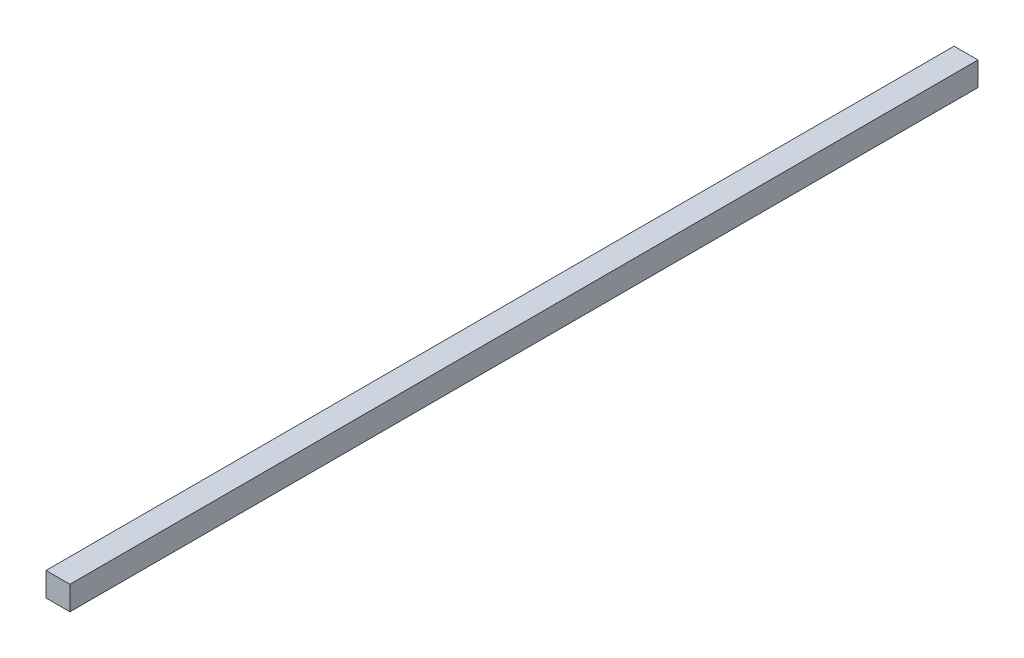
ISO-10303-21;
HEADER;
FILE_DESCRIPTION(('STEP AP214'),'2;1');
FILE_NAME('part.step','',(''),(''),'','','');
FILE_SCHEMA(('AUTOMOTIVE_DESIGN { 1 0 10303 214 1 1 1 1 }'));
ENDSEC;
DATA;
#1=APPLICATION_CONTEXT('core data for automotive mechanical design processes');
#2=APPLICATION_PROTOCOL_DEFINITION('international standard','automotive_design',2000,#1);
#3=PRODUCT_CONTEXT('',#1,'mechanical');
#4=PRODUCT('Part','Part','',(#3));
#5=PRODUCT_RELATED_PRODUCT_CATEGORY('part','',(#4));
#6=PRODUCT_DEFINITION_FORMATION('','',#4);
#7=PRODUCT_DEFINITION_CONTEXT('part definition',#1,'design');
#8=PRODUCT_DEFINITION('design','',#6,#7);
#9=PRODUCT_DEFINITION_SHAPE('','',#8);
#10=(LENGTH_UNIT() NAMED_UNIT(*) SI_UNIT(.MILLI.,.METRE.));
#11=(NAMED_UNIT(*) PLANE_ANGLE_UNIT() SI_UNIT($,.RADIAN.));
#12=(NAMED_UNIT(*) SI_UNIT($,.STERADIAN.) SOLID_ANGLE_UNIT());
#13=UNCERTAINTY_MEASURE_WITH_UNIT(LENGTH_MEASURE(1.E-05),#10,'distance_accuracy_value','');
#14=(GEOMETRIC_REPRESENTATION_CONTEXT(3) GLOBAL_UNCERTAINTY_ASSIGNED_CONTEXT((#13)) GLOBAL_UNIT_ASSIGNED_CONTEXT((#10,
#11,#12)) REPRESENTATION_CONTEXT('',''));
#15=CARTESIAN_POINT('',(0.,0.,0.));
#16=DIRECTION('',(0.,0.,1.));
#17=DIRECTION('',(1.,0.,0.));
#18=AXIS2_PLACEMENT_3D('',#15,#16,#17);
#19=CARTESIAN_POINT('',(10.,20.,380.));
#20=DIRECTION('',(-1.,0.,0.));
#21=DIRECTION('',(0.,0.,1.));
#22=AXIS2_PLACEMENT_3D('',#19,#20,#21);
#23=PLANE('',#22);
#24=DIRECTION('',(0.,0.,-1.));
#25=VECTOR('',#24,1.);
#26=CARTESIAN_POINT('',(10.,0.,380.));
#27=LINE('',#26,#25);
#28=CARTESIAN_POINT('',(10.,0.,380.));
#29=VERTEX_POINT('',#28);
#30=CARTESIAN_POINT('',(10.,0.,-380.));
#31=VERTEX_POINT('',#30);
#32=EDGE_CURVE('E96',#29,#31,#27,.T.);
#33=ORIENTED_EDGE('',*,*,#32,.T.);
#34=DIRECTION('',(0.,-1.,0.));
#35=VECTOR('',#34,1.);
#36=CARTESIAN_POINT('',(10.,20.,-380.));
#37=LINE('',#36,#35);
#38=CARTESIAN_POINT('',(10.,20.,-380.));
#39=VERTEX_POINT('',#38);
#40=EDGE_CURVE('E11',#39,#31,#37,.T.);
#41=ORIENTED_EDGE('',*,*,#40,.F.);
#42=DIRECTION('',(0.,0.,-1.));
#43=VECTOR('',#42,1.);
#44=CARTESIAN_POINT('',(10.,20.,380.));
#45=LINE('',#44,#43);
#46=CARTESIAN_POINT('',(10.,20.,380.));
#47=VERTEX_POINT('',#46);
#48=EDGE_CURVE('E84',#47,#39,#45,.T.);
#49=ORIENTED_EDGE('',*,*,#48,.F.);
#50=DIRECTION('',(0.,-1.,0.));
#51=VECTOR('',#50,1.);
#52=CARTESIAN_POINT('',(10.,20.,380.));
#53=LINE('',#52,#51);
#54=EDGE_CURVE('E92',#47,#29,#53,.T.);
#55=ORIENTED_EDGE('',*,*,#54,.T.);
#56=EDGE_LOOP('',(#33,#41,#49,#55));
#57=FACE_BOUND('',#56,.T.);
#58=ADVANCED_FACE('F33',(#57),#23,.F.);
#59=CARTESIAN_POINT('',(-10.,20.,-380.));
#60=DIRECTION('',(0.,0.,1.));
#61=DIRECTION('',(1.,0.,0.));
#62=AXIS2_PLACEMENT_3D('',#59,#60,#61);
#63=PLANE('',#62);
#64=DIRECTION('',(-1.,0.,0.));
#65=VECTOR('',#64,1.);
#66=CARTESIAN_POINT('',(-10.,0.,-380.));
#67=LINE('',#66,#65);
#68=CARTESIAN_POINT('',(-10.,0.,-380.));
#69=VERTEX_POINT('',#68);
#70=EDGE_CURVE('E88',#31,#69,#67,.T.);
#71=ORIENTED_EDGE('',*,*,#70,.T.);
#72=DIRECTION('',(0.,-1.,0.));
#73=VECTOR('',#72,1.);
#74=CARTESIAN_POINT('',(-10.,20.,-380.));
#75=LINE('',#74,#73);
#76=CARTESIAN_POINT('',(-10.,20.,-380.));
#77=VERTEX_POINT('',#76);
#78=EDGE_CURVE('E41',#77,#69,#75,.T.);
#79=ORIENTED_EDGE('',*,*,#78,.F.);
#80=DIRECTION('',(-1.,0.,0.));
#81=VECTOR('',#80,1.);
#82=CARTESIAN_POINT('',(-10.,20.,-380.));
#83=LINE('',#82,#81);
#84=EDGE_CURVE('E79',#39,#77,#83,.T.);
#85=ORIENTED_EDGE('',*,*,#84,.F.);
#86=ORIENTED_EDGE('',*,*,#40,.T.);
#87=EDGE_LOOP('',(#71,#79,#85,#86));
#88=FACE_BOUND('',#87,.T.);
#89=ADVANCED_FACE('F87',(#88),#63,.F.);
#90=CARTESIAN_POINT('',(-10.,20.,380.));
#91=DIRECTION('',(1.,0.,0.));
#92=DIRECTION('',(0.,0.,-1.));
#93=AXIS2_PLACEMENT_3D('',#90,#91,#92);
#94=PLANE('',#93);
#95=DIRECTION('',(0.,0.,1.));
#96=VECTOR('',#95,1.);
#97=CARTESIAN_POINT('',(-10.,0.,380.));
#98=LINE('',#97,#96);
#99=CARTESIAN_POINT('',(-10.,0.,380.));
#100=VERTEX_POINT('',#99);
#101=EDGE_CURVE('E66',#69,#100,#98,.T.);
#102=ORIENTED_EDGE('',*,*,#101,.T.);
#103=DIRECTION('',(0.,-1.,0.));
#104=VECTOR('',#103,1.);
#105=CARTESIAN_POINT('',(-10.,20.,380.));
#106=LINE('',#105,#104);
#107=CARTESIAN_POINT('',(-10.,20.,380.));
#108=VERTEX_POINT('',#107);
#109=EDGE_CURVE('E89',#108,#100,#106,.T.);
#110=ORIENTED_EDGE('',*,*,#109,.F.);
#111=DIRECTION('',(0.,0.,1.));
#112=VECTOR('',#111,1.);
#113=CARTESIAN_POINT('',(-10.,20.,380.));
#114=LINE('',#113,#112);
#115=EDGE_CURVE('E82',#77,#108,#114,.T.);
#116=ORIENTED_EDGE('',*,*,#115,.F.);
#117=ORIENTED_EDGE('',*,*,#78,.T.);
#118=EDGE_LOOP('',(#102,#110,#116,#117));
#119=FACE_BOUND('',#118,.T.);
#120=ADVANCED_FACE('F90',(#119),#94,.F.);
#121=CARTESIAN_POINT('',(-10.,20.,380.));
#122=DIRECTION('',(0.,0.,-1.));
#123=DIRECTION('',(-1.,0.,0.));
#124=AXIS2_PLACEMENT_3D('',#121,#122,#123);
#125=PLANE('',#124);
#126=DIRECTION('',(1.,0.,0.));
#127=VECTOR('',#126,1.);
#128=CARTESIAN_POINT('',(-10.,0.,380.));
#129=LINE('',#128,#127);
#130=EDGE_CURVE('E72',#100,#29,#129,.T.);
#131=ORIENTED_EDGE('',*,*,#130,.T.);
#132=ORIENTED_EDGE('',*,*,#54,.F.);
#133=DIRECTION('',(1.,0.,0.));
#134=VECTOR('',#133,1.);
#135=CARTESIAN_POINT('',(-10.,20.,380.));
#136=LINE('',#135,#134);
#137=EDGE_CURVE('E49',#108,#47,#136,.T.);
#138=ORIENTED_EDGE('',*,*,#137,.F.);
#139=ORIENTED_EDGE('',*,*,#109,.T.);
#140=EDGE_LOOP('',(#131,#132,#138,#139));
#141=FACE_BOUND('',#140,.T.);
#142=ADVANCED_FACE('F103',(#141),#125,.F.);
#143=CARTESIAN_POINT('',(0.,20.,0.));
#144=DIRECTION('',(0.,-1.,0.));
#145=DIRECTION('',(0.,0.,-1.));
#146=AXIS2_PLACEMENT_3D('',#143,#144,#145);
#147=PLANE('',#146);
#148=ORIENTED_EDGE('',*,*,#48,.T.);
#149=ORIENTED_EDGE('',*,*,#84,.T.);
#150=ORIENTED_EDGE('',*,*,#115,.T.);
#151=ORIENTED_EDGE('',*,*,#137,.T.);
#152=EDGE_LOOP('',(#148,#149,#150,#151));
#153=FACE_BOUND('',#152,.T.);
#154=ADVANCED_FACE('F80',(#153),#147,.F.);
#155=CARTESIAN_POINT('',(0.,0.,0.));
#156=DIRECTION('',(0.,-1.,0.));
#157=DIRECTION('',(0.,0.,-1.));
#158=AXIS2_PLACEMENT_3D('',#155,#156,#157);
#159=PLANE('',#158);
#160=ORIENTED_EDGE('',*,*,#32,.F.);
#161=ORIENTED_EDGE('',*,*,#130,.F.);
#162=ORIENTED_EDGE('',*,*,#101,.F.);
#163=ORIENTED_EDGE('',*,*,#70,.F.);
#164=EDGE_LOOP('',(#160,#161,#162,#163));
#165=FACE_BOUND('',#164,.T.);
#166=ADVANCED_FACE('F106',(#165),#159,.T.);
#167=CLOSED_SHELL('',(#58,#89,#120,#142,#154,#166));
#168=MANIFOLD_SOLID_BREP('B2',#167);
#169=ADVANCED_BREP_SHAPE_REPRESENTATION('',(#18,#168),#14);
#170=SHAPE_DEFINITION_REPRESENTATION(#9,#169);
ENDSEC;
END-ISO-10303-21;
